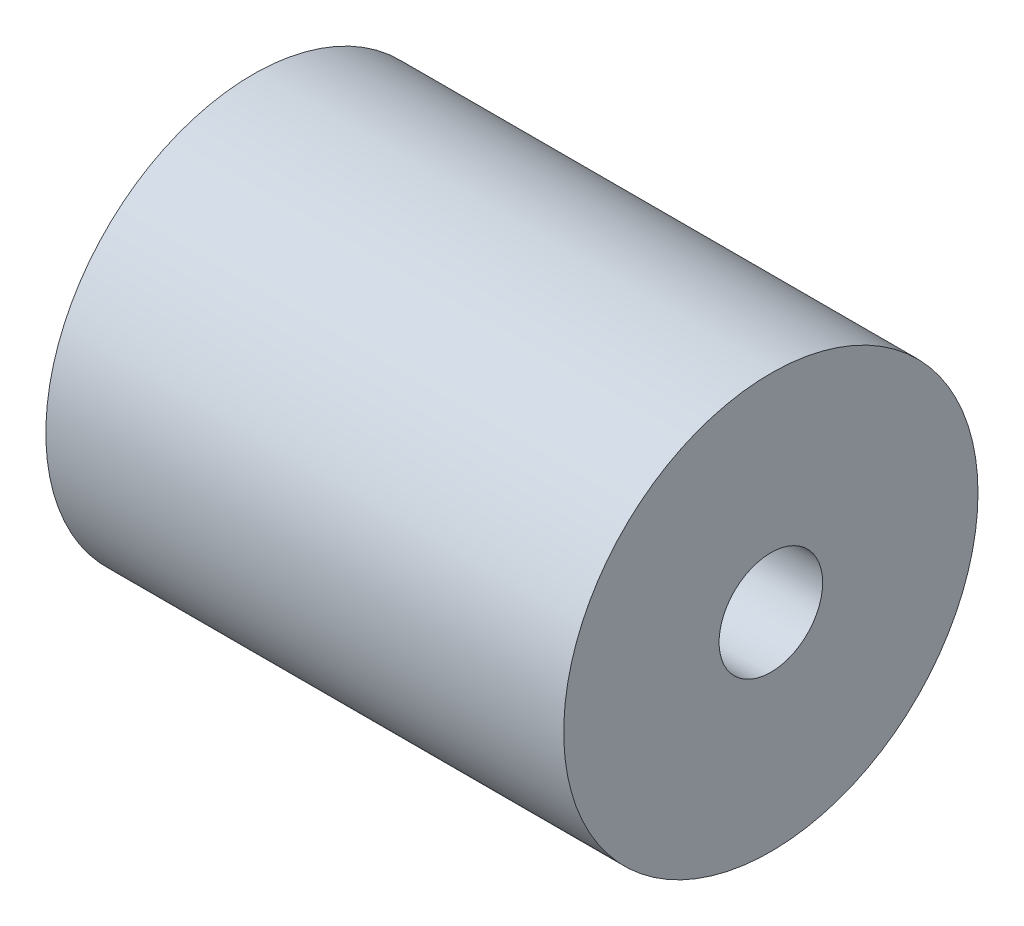
ISO-10303-21;
HEADER;
FILE_DESCRIPTION(('STEP AP214'),'2;1');
FILE_NAME('part.step','',(''),(''),'','','');
FILE_SCHEMA(('AUTOMOTIVE_DESIGN { 1 0 10303 214 1 1 1 1 }'));
ENDSEC;
DATA;
#1=APPLICATION_CONTEXT('core data for automotive mechanical design processes');
#2=APPLICATION_PROTOCOL_DEFINITION('international standard','automotive_design',2000,#1);
#3=PRODUCT_CONTEXT('',#1,'mechanical');
#4=PRODUCT('Part','Part','',(#3));
#5=PRODUCT_RELATED_PRODUCT_CATEGORY('part','',(#4));
#6=PRODUCT_DEFINITION_FORMATION('','',#4);
#7=PRODUCT_DEFINITION_CONTEXT('part definition',#1,'design');
#8=PRODUCT_DEFINITION('design','',#6,#7);
#9=PRODUCT_DEFINITION_SHAPE('','',#8);
#10=(LENGTH_UNIT() NAMED_UNIT(*) SI_UNIT(.MILLI.,.METRE.));
#11=(NAMED_UNIT(*) PLANE_ANGLE_UNIT() SI_UNIT($,.RADIAN.));
#12=(NAMED_UNIT(*) SI_UNIT($,.STERADIAN.) SOLID_ANGLE_UNIT());
#13=UNCERTAINTY_MEASURE_WITH_UNIT(LENGTH_MEASURE(1.E-05),#10,'distance_accuracy_value','');
#14=(GEOMETRIC_REPRESENTATION_CONTEXT(3) GLOBAL_UNCERTAINTY_ASSIGNED_CONTEXT((#13)) GLOBAL_UNIT_ASSIGNED_CONTEXT((#10,
#11,#12)) REPRESENTATION_CONTEXT('',''));
#15=CARTESIAN_POINT('',(0.,0.,0.));
#16=DIRECTION('',(0.,0.,1.));
#17=DIRECTION('',(1.,0.,0.));
#18=AXIS2_PLACEMENT_3D('',#15,#16,#17);
#19=CARTESIAN_POINT('',(-7.5,0.,0.));
#20=DIRECTION('',(1.,0.,0.));
#21=DIRECTION('',(0.,0.,-1.));
#22=AXIS2_PLACEMENT_3D('',#19,#20,#21);
#23=CYLINDRICAL_SURFACE('',#22,10.);
#24=CARTESIAN_POINT('',(-7.5,0.,0.));
#25=DIRECTION('',(1.,0.,0.));
#26=DIRECTION('',(0.,0.,-1.));
#27=AXIS2_PLACEMENT_3D('',#24,#25,#26);
#28=CIRCLE('',#27,10.);
#29=CARTESIAN_POINT('',(-7.5,0.,-10.));
#30=VERTEX_POINT('',#29);
#31=EDGE_CURVE('E10',#30,#30,#28,.T.);
#32=ORIENTED_EDGE('',*,*,#31,.T.);
#33=EDGE_LOOP('',(#32));
#34=FACE_BOUND('',#33,.T.);
#35=CARTESIAN_POINT('',(17.5,0.,0.));
#36=DIRECTION('',(1.,0.,0.));
#37=DIRECTION('',(0.,0.,-1.));
#38=AXIS2_PLACEMENT_3D('',#35,#36,#37);
#39=CIRCLE('',#38,10.);
#40=CARTESIAN_POINT('',(17.5,0.,-10.));
#41=VERTEX_POINT('',#40);
#42=EDGE_CURVE('E43',#41,#41,#39,.T.);
#43=ORIENTED_EDGE('',*,*,#42,.F.);
#44=EDGE_LOOP('',(#43));
#45=FACE_BOUND('',#44,.T.);
#46=ADVANCED_FACE('F33',(#34,#45),#23,.T.);
#47=CARTESIAN_POINT('',(-7.5,0.,0.));
#48=DIRECTION('',(1.,0.,0.));
#49=DIRECTION('',(0.,0.,-1.));
#50=AXIS2_PLACEMENT_3D('',#47,#48,#49);
#51=PLANE('',#50);
#52=CARTESIAN_POINT('',(-7.5,0.,0.));
#53=DIRECTION('',(1.,0.,0.));
#54=DIRECTION('',(0.,0.,-1.));
#55=AXIS2_PLACEMENT_3D('',#52,#53,#54);
#56=CIRCLE('',#55,2.5);
#57=CARTESIAN_POINT('',(-7.5,0.,-2.5));
#58=VERTEX_POINT('',#57);
#59=EDGE_CURVE('E39',#58,#58,#56,.T.);
#60=ORIENTED_EDGE('',*,*,#59,.T.);
#61=EDGE_LOOP('',(#60));
#62=FACE_BOUND('',#61,.T.);
#63=ORIENTED_EDGE('',*,*,#31,.F.);
#64=EDGE_LOOP('',(#63));
#65=FACE_BOUND('',#64,.T.);
#66=ADVANCED_FACE('F62',(#62,#65),#51,.F.);
#67=CARTESIAN_POINT('',(-7.5,0.,0.));
#68=DIRECTION('',(1.,0.,0.));
#69=DIRECTION('',(0.,0.,-1.));
#70=AXIS2_PLACEMENT_3D('',#67,#68,#69);
#71=CYLINDRICAL_SURFACE('',#70,2.5);
#72=ORIENTED_EDGE('',*,*,#59,.F.);
#73=EDGE_LOOP('',(#72));
#74=FACE_BOUND('',#73,.T.);
#75=CARTESIAN_POINT('',(17.5,0.,0.));
#76=DIRECTION('',(1.,0.,0.));
#77=DIRECTION('',(0.,0.,-1.));
#78=AXIS2_PLACEMENT_3D('',#75,#76,#77);
#79=CIRCLE('',#78,2.5);
#80=CARTESIAN_POINT('',(17.5,0.,-2.5));
#81=VERTEX_POINT('',#80);
#82=EDGE_CURVE('E47',#81,#81,#79,.T.);
#83=ORIENTED_EDGE('',*,*,#82,.T.);
#84=EDGE_LOOP('',(#83));
#85=FACE_BOUND('',#84,.T.);
#86=ADVANCED_FACE('F53',(#74,#85),#71,.F.);
#87=CARTESIAN_POINT('',(17.5,0.,0.));
#88=DIRECTION('',(1.,0.,0.));
#89=DIRECTION('',(0.,0.,-1.));
#90=AXIS2_PLACEMENT_3D('',#87,#88,#89);
#91=PLANE('',#90);
#92=ORIENTED_EDGE('',*,*,#42,.T.);
#93=EDGE_LOOP('',(#92));
#94=FACE_BOUND('',#93,.T.);
#95=ORIENTED_EDGE('',*,*,#82,.F.);
#96=EDGE_LOOP('',(#95));
#97=FACE_BOUND('',#96,.T.);
#98=ADVANCED_FACE('F55',(#94,#97),#91,.T.);
#99=CLOSED_SHELL('',(#46,#66,#86,#98));
#100=MANIFOLD_SOLID_BREP('B2',#99);
#101=ADVANCED_BREP_SHAPE_REPRESENTATION('',(#18,#100),#14);
#102=SHAPE_DEFINITION_REPRESENTATION(#9,#101);
ENDSEC;
END-ISO-10303-21;
